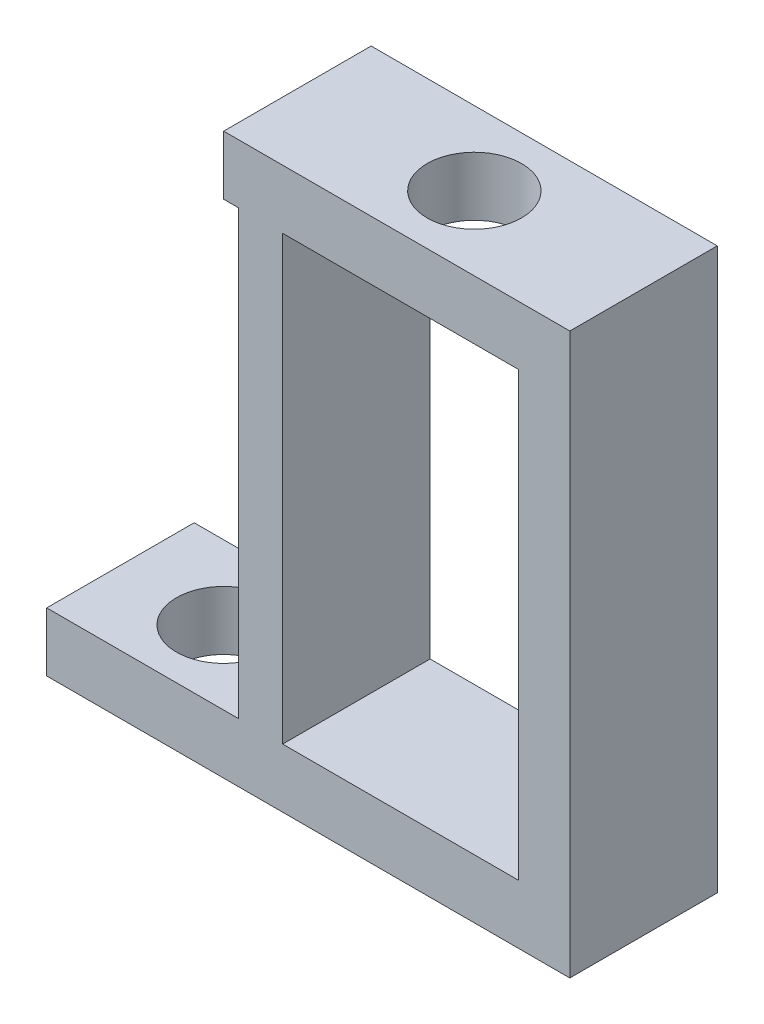
ISO-10303-21;
HEADER;
FILE_DESCRIPTION(('STEP AP214'),'2;1');
FILE_NAME('part.step','',(''),(''),'','','');
FILE_SCHEMA(('AUTOMOTIVE_DESIGN { 1 0 10303 214 1 1 1 1 }'));
ENDSEC;
DATA;
#1=APPLICATION_CONTEXT('core data for automotive mechanical design processes');
#2=APPLICATION_PROTOCOL_DEFINITION('international standard','automotive_design',2000,#1);
#3=PRODUCT_CONTEXT('',#1,'mechanical');
#4=PRODUCT('Part','Part','',(#3));
#5=PRODUCT_RELATED_PRODUCT_CATEGORY('part','',(#4));
#6=PRODUCT_DEFINITION_FORMATION('','',#4);
#7=PRODUCT_DEFINITION_CONTEXT('part definition',#1,'design');
#8=PRODUCT_DEFINITION('design','',#6,#7);
#9=PRODUCT_DEFINITION_SHAPE('','',#8);
#10=(LENGTH_UNIT() NAMED_UNIT(*) SI_UNIT(.MILLI.,.METRE.));
#11=(NAMED_UNIT(*) PLANE_ANGLE_UNIT() SI_UNIT($,.RADIAN.));
#12=(NAMED_UNIT(*) SI_UNIT($,.STERADIAN.) SOLID_ANGLE_UNIT());
#13=UNCERTAINTY_MEASURE_WITH_UNIT(LENGTH_MEASURE(1.E-05),#10,'distance_accuracy_value','');
#14=(GEOMETRIC_REPRESENTATION_CONTEXT(3) GLOBAL_UNCERTAINTY_ASSIGNED_CONTEXT((#13)) GLOBAL_UNIT_ASSIGNED_CONTEXT((#10,
#11,#12)) REPRESENTATION_CONTEXT('',''));
#15=CARTESIAN_POINT('',(0.,0.,0.));
#16=DIRECTION('',(0.,0.,1.));
#17=DIRECTION('',(1.,0.,0.));
#18=AXIS2_PLACEMENT_3D('',#15,#16,#17);
#19=CARTESIAN_POINT('',(0.,0.,0.));
#20=DIRECTION('',(0.,1.,0.));
#21=DIRECTION('',(0.,0.,1.));
#22=AXIS2_PLACEMENT_3D('',#19,#20,#21);
#23=PLANE('',#22);
#24=DIRECTION('',(0.,0.,-1.));
#25=VECTOR('',#24,1.);
#26=CARTESIAN_POINT('',(-6.5,0.,2.));
#27=LINE('',#26,#25);
#28=CARTESIAN_POINT('',(-6.5,0.,2.));
#29=VERTEX_POINT('',#28);
#30=CARTESIAN_POINT('',(-6.5,0.,-3.));
#31=VERTEX_POINT('',#30);
#32=EDGE_CURVE('E213',#29,#31,#27,.T.);
#33=ORIENTED_EDGE('',*,*,#32,.F.);
#34=DIRECTION('',(1.,0.,0.));
#35=VECTOR('',#34,1.);
#36=CARTESIAN_POINT('',(-7.,0.,2.));
#37=LINE('',#36,#35);
#38=CARTESIAN_POINT('',(-7.,0.,2.));
#39=VERTEX_POINT('',#38);
#40=EDGE_CURVE('E228',#39,#29,#37,.T.);
#41=ORIENTED_EDGE('',*,*,#40,.F.);
#42=DIRECTION('',(0.,0.,1.));
#43=VECTOR('',#42,1.);
#44=CARTESIAN_POINT('',(-7.,0.,-3.));
#45=LINE('',#44,#43);
#46=CARTESIAN_POINT('',(-7.,0.,-3.));
#47=VERTEX_POINT('',#46);
#48=EDGE_CURVE('E237',#47,#39,#45,.T.);
#49=ORIENTED_EDGE('',*,*,#48,.F.);
#50=DIRECTION('',(-1.,0.,0.));
#51=VECTOR('',#50,1.);
#52=CARTESIAN_POINT('',(-7.,0.,-3.));
#53=LINE('',#52,#51);
#54=EDGE_CURVE('E53',#31,#47,#53,.T.);
#55=ORIENTED_EDGE('',*,*,#54,.F.);
#56=EDGE_LOOP('',(#33,#41,#49,#55));
#57=FACE_BOUND('',#56,.T.);
#58=ADVANCED_FACE('F35',(#57),#23,.F.);
#59=CARTESIAN_POINT('',(-0.999999999999999,0.,-0.500000000000001));
#60=DIRECTION('',(0.,1.,0.));
#61=DIRECTION('',(0.,0.,1.));
#62=AXIS2_PLACEMENT_3D('',#59,#60,#61);
#63=CIRCLE('',#62,1.6);
#64=CARTESIAN_POINT('',(-0.999999999999999,0.,1.1));
#65=VERTEX_POINT('',#64);
#66=EDGE_CURVE('E210',#65,#65,#63,.T.);
#67=ORIENTED_EDGE('',*,*,#66,.T.);
#68=EDGE_LOOP('',(#67));
#69=FACE_BOUND('',#68,.T.);
#70=DIRECTION('',(0.,0.,1.));
#71=VECTOR('',#70,1.);
#72=CARTESIAN_POINT('',(-5.,0.,2.));
#73=LINE('',#72,#71);
#74=CARTESIAN_POINT('',(-5.,0.,-3.));
#75=VERTEX_POINT('',#74);
#76=CARTESIAN_POINT('',(-5.,0.,2.));
#77=VERTEX_POINT('',#76);
#78=EDGE_CURVE('E198',#75,#77,#73,.T.);
#79=ORIENTED_EDGE('',*,*,#78,.F.);
#80=CARTESIAN_POINT('',(3.,0.,-3.));
#81=VERTEX_POINT('',#80);
#82=EDGE_CURVE('E255',#81,#75,#53,.T.);
#83=ORIENTED_EDGE('',*,*,#82,.F.);
#84=DIRECTION('',(0.,0.,-1.));
#85=VECTOR('',#84,1.);
#86=CARTESIAN_POINT('',(3.,0.,-3.));
#87=LINE('',#86,#85);
#88=CARTESIAN_POINT('',(3.,0.,2.));
#89=VERTEX_POINT('',#88);
#90=EDGE_CURVE('E135',#89,#81,#87,.T.);
#91=ORIENTED_EDGE('',*,*,#90,.F.);
#92=EDGE_CURVE('E232',#77,#89,#37,.T.);
#93=ORIENTED_EDGE('',*,*,#92,.F.);
#94=EDGE_LOOP('',(#79,#83,#91,#93));
#95=FACE_BOUND('',#94,.T.);
#96=ADVANCED_FACE('F262',(#69,#95),#23,.F.);
#97=CARTESIAN_POINT('',(0.,2.,0.));
#98=DIRECTION('',(0.,1.,0.));
#99=DIRECTION('',(0.,0.,1.));
#100=AXIS2_PLACEMENT_3D('',#97,#98,#99);
#101=PLANE('',#100);
#102=DIRECTION('',(1.,0.,0.));
#103=VECTOR('',#102,1.);
#104=CARTESIAN_POINT('',(-7.,2.,2.));
#105=LINE('',#104,#103);
#106=CARTESIAN_POINT('',(-7.,2.,2.));
#107=VERTEX_POINT('',#106);
#108=CARTESIAN_POINT('',(4.73770260739299,2.,2.));
#109=VERTEX_POINT('',#108);
#110=EDGE_CURVE('E246',#107,#109,#105,.T.);
#111=ORIENTED_EDGE('',*,*,#110,.T.);
#112=DIRECTION('',(0.,0.,1.));
#113=VECTOR('',#112,1.);
#114=CARTESIAN_POINT('',(4.73770260739299,2.,-3.));
#115=LINE('',#114,#113);
#116=CARTESIAN_POINT('',(4.73770260739299,2.,-3.));
#117=VERTEX_POINT('',#116);
#118=EDGE_CURVE('E159',#117,#109,#115,.T.);
#119=ORIENTED_EDGE('',*,*,#118,.F.);
#120=DIRECTION('',(-1.,0.,0.));
#121=VECTOR('',#120,1.);
#122=CARTESIAN_POINT('',(-7.,2.,-3.));
#123=LINE('',#122,#121);
#124=CARTESIAN_POINT('',(-7.,2.,-3.));
#125=VERTEX_POINT('',#124);
#126=EDGE_CURVE('E231',#117,#125,#123,.T.);
#127=ORIENTED_EDGE('',*,*,#126,.T.);
#128=DIRECTION('',(0.,0.,1.));
#129=VECTOR('',#128,1.);
#130=CARTESIAN_POINT('',(-7.,2.,-3.));
#131=LINE('',#130,#129);
#132=EDGE_CURVE('E234',#125,#107,#131,.T.);
#133=ORIENTED_EDGE('',*,*,#132,.T.);
#134=EDGE_LOOP('',(#111,#119,#127,#133));
#135=FACE_BOUND('',#134,.T.);
#136=CARTESIAN_POINT('',(-0.999999999999999,2.,-0.500000000000001));
#137=DIRECTION('',(0.,1.,0.));
#138=DIRECTION('',(0.,0.,1.));
#139=AXIS2_PLACEMENT_3D('',#136,#137,#138);
#140=CIRCLE('',#139,1.6);
#141=CARTESIAN_POINT('',(-0.999999999999999,2.,1.1));
#142=VERTEX_POINT('',#141);
#143=EDGE_CURVE('E252',#142,#142,#140,.T.);
#144=ORIENTED_EDGE('',*,*,#143,.F.);
#145=EDGE_LOOP('',(#144));
#146=FACE_BOUND('',#145,.T.);
#147=ADVANCED_FACE('F267',(#135,#146),#101,.T.);
#148=CARTESIAN_POINT('',(-7.,2.,-3.));
#149=DIRECTION('',(0.,0.,1.));
#150=DIRECTION('',(1.,0.,0.));
#151=AXIS2_PLACEMENT_3D('',#148,#149,#150);
#152=PLANE('',#151);
#153=DIRECTION('',(0.,-1.,0.));
#154=VECTOR('',#153,1.);
#155=CARTESIAN_POINT('',(3.,2.,-3.));
#156=LINE('',#155,#154);
#157=CARTESIAN_POINT('',(3.,-15.,-3.));
#158=VERTEX_POINT('',#157);
#159=EDGE_CURVE('E129',#81,#158,#156,.T.);
#160=ORIENTED_EDGE('',*,*,#159,.F.);
#161=ORIENTED_EDGE('',*,*,#82,.T.);
#162=DIRECTION('',(0.,1.,0.));
#163=VECTOR('',#162,1.);
#164=CARTESIAN_POINT('',(-5.,-15.,-3.));
#165=LINE('',#164,#163);
#166=CARTESIAN_POINT('',(-5.,-15.,-3.));
#167=VERTEX_POINT('',#166);
#168=EDGE_CURVE('E39',#167,#75,#165,.T.);
#169=ORIENTED_EDGE('',*,*,#168,.F.);
#170=DIRECTION('',(-1.,0.,0.));
#171=VECTOR('',#170,1.);
#172=CARTESIAN_POINT('',(3.,-15.,-3.));
#173=LINE('',#172,#171);
#174=EDGE_CURVE('E139',#158,#167,#173,.T.);
#175=ORIENTED_EDGE('',*,*,#174,.F.);
#176=EDGE_LOOP('',(#160,#161,#169,#175));
#177=FACE_BOUND('',#176,.T.);
#178=ORIENTED_EDGE('',*,*,#126,.F.);
#179=DIRECTION('',(0.,1.,0.));
#180=VECTOR('',#179,1.);
#181=CARTESIAN_POINT('',(4.73770260739299,-17.,-3.));
#182=LINE('',#181,#180);
#183=CARTESIAN_POINT('',(4.73770260739299,-17.,-3.));
#184=VERTEX_POINT('',#183);
#185=EDGE_CURVE('E147',#184,#117,#182,.T.);
#186=ORIENTED_EDGE('',*,*,#185,.F.);
#187=DIRECTION('',(1.,0.,0.));
#188=VECTOR('',#187,1.);
#189=CARTESIAN_POINT('',(-5.,-17.,-3.));
#190=LINE('',#189,#188);
#191=CARTESIAN_POINT('',(-13.,-17.,-3.));
#192=VERTEX_POINT('',#191);
#193=EDGE_CURVE('E178',#192,#184,#190,.T.);
#194=ORIENTED_EDGE('',*,*,#193,.F.);
#195=DIRECTION('',(0.,1.,0.));
#196=VECTOR('',#195,1.);
#197=CARTESIAN_POINT('',(-13.,-17.,-3.));
#198=LINE('',#197,#196);
#199=CARTESIAN_POINT('',(-13.,-15.,-3.));
#200=VERTEX_POINT('',#199);
#201=EDGE_CURVE('E180',#192,#200,#198,.T.);
#202=ORIENTED_EDGE('',*,*,#201,.T.);
#203=DIRECTION('',(1.,0.,0.));
#204=VECTOR('',#203,1.);
#205=CARTESIAN_POINT('',(-5.,-15.,-3.));
#206=LINE('',#205,#204);
#207=CARTESIAN_POINT('',(-6.5,-15.,-3.));
#208=VERTEX_POINT('',#207);
#209=EDGE_CURVE('E176',#200,#208,#206,.T.);
#210=ORIENTED_EDGE('',*,*,#209,.T.);
#211=DIRECTION('',(0.,1.,0.));
#212=VECTOR('',#211,1.);
#213=CARTESIAN_POINT('',(-6.5,-15.,-3.));
#214=LINE('',#213,#212);
#215=EDGE_CURVE('E208',#208,#31,#214,.T.);
#216=ORIENTED_EDGE('',*,*,#215,.T.);
#217=ORIENTED_EDGE('',*,*,#54,.T.);
#218=DIRECTION('',(0.,-1.,0.));
#219=VECTOR('',#218,1.);
#220=CARTESIAN_POINT('',(-7.,2.,-3.));
#221=LINE('',#220,#219);
#222=EDGE_CURVE('E11',#125,#47,#221,.T.);
#223=ORIENTED_EDGE('',*,*,#222,.F.);
#224=EDGE_LOOP('',(#178,#186,#194,#202,#210,#216,#217,#223));
#225=FACE_BOUND('',#224,.T.);
#226=ADVANCED_FACE('F37',(#177,#225),#152,.F.);
#227=CARTESIAN_POINT('',(-7.,2.,-3.));
#228=DIRECTION('',(1.,0.,0.));
#229=DIRECTION('',(0.,0.,-1.));
#230=AXIS2_PLACEMENT_3D('',#227,#228,#229);
#231=PLANE('',#230);
#232=ORIENTED_EDGE('',*,*,#48,.T.);
#233=DIRECTION('',(0.,-1.,0.));
#234=VECTOR('',#233,1.);
#235=CARTESIAN_POINT('',(-7.,2.,2.));
#236=LINE('',#235,#234);
#237=EDGE_CURVE('E45',#107,#39,#236,.T.);
#238=ORIENTED_EDGE('',*,*,#237,.F.);
#239=ORIENTED_EDGE('',*,*,#132,.F.);
#240=ORIENTED_EDGE('',*,*,#222,.T.);
#241=EDGE_LOOP('',(#232,#238,#239,#240));
#242=FACE_BOUND('',#241,.T.);
#243=ADVANCED_FACE('F260',(#242),#231,.F.);
#244=CARTESIAN_POINT('',(-7.,2.,2.));
#245=DIRECTION('',(0.,0.,-1.));
#246=DIRECTION('',(-1.,0.,0.));
#247=AXIS2_PLACEMENT_3D('',#244,#245,#246);
#248=PLANE('',#247);
#249=ORIENTED_EDGE('',*,*,#92,.T.);
#250=DIRECTION('',(0.,-1.,0.));
#251=VECTOR('',#250,1.);
#252=CARTESIAN_POINT('',(3.,2.,2.));
#253=LINE('',#252,#251);
#254=CARTESIAN_POINT('',(3.,-15.,2.));
#255=VERTEX_POINT('',#254);
#256=EDGE_CURVE('E154',#89,#255,#253,.T.);
#257=ORIENTED_EDGE('',*,*,#256,.T.);
#258=DIRECTION('',(-1.,0.,0.));
#259=VECTOR('',#258,1.);
#260=CARTESIAN_POINT('',(3.,-15.,2.));
#261=LINE('',#260,#259);
#262=CARTESIAN_POINT('',(-5.,-15.,2.));
#263=VERTEX_POINT('',#262);
#264=EDGE_CURVE('E145',#255,#263,#261,.T.);
#265=ORIENTED_EDGE('',*,*,#264,.T.);
#266=DIRECTION('',(0.,1.,0.));
#267=VECTOR('',#266,1.);
#268=CARTESIAN_POINT('',(-5.,-15.,2.));
#269=LINE('',#268,#267);
#270=EDGE_CURVE('E201',#263,#77,#269,.T.);
#271=ORIENTED_EDGE('',*,*,#270,.T.);
#272=EDGE_LOOP('',(#249,#257,#265,#271));
#273=FACE_BOUND('',#272,.T.);
#274=ORIENTED_EDGE('',*,*,#40,.T.);
#275=DIRECTION('',(0.,1.,0.));
#276=VECTOR('',#275,1.);
#277=CARTESIAN_POINT('',(-6.5,-15.,2.));
#278=LINE('',#277,#276);
#279=CARTESIAN_POINT('',(-6.5,-15.,2.));
#280=VERTEX_POINT('',#279);
#281=EDGE_CURVE('E197',#280,#29,#278,.T.);
#282=ORIENTED_EDGE('',*,*,#281,.F.);
#283=DIRECTION('',(-1.,0.,0.));
#284=VECTOR('',#283,1.);
#285=CARTESIAN_POINT('',(-5.,-15.,2.));
#286=LINE('',#285,#284);
#287=CARTESIAN_POINT('',(-13.,-15.,2.));
#288=VERTEX_POINT('',#287);
#289=EDGE_CURVE('E170',#280,#288,#286,.T.);
#290=ORIENTED_EDGE('',*,*,#289,.T.);
#291=DIRECTION('',(0.,1.,0.));
#292=VECTOR('',#291,1.);
#293=CARTESIAN_POINT('',(-13.,-17.,2.));
#294=LINE('',#293,#292);
#295=CARTESIAN_POINT('',(-13.,-17.,2.));
#296=VERTEX_POINT('',#295);
#297=EDGE_CURVE('E215',#296,#288,#294,.T.);
#298=ORIENTED_EDGE('',*,*,#297,.F.);
#299=DIRECTION('',(-1.,0.,0.));
#300=VECTOR('',#299,1.);
#301=CARTESIAN_POINT('',(-5.,-17.,2.));
#302=LINE('',#301,#300);
#303=CARTESIAN_POINT('',(4.73770260739299,-17.,2.));
#304=VERTEX_POINT('',#303);
#305=EDGE_CURVE('E173',#304,#296,#302,.T.);
#306=ORIENTED_EDGE('',*,*,#305,.F.);
#307=DIRECTION('',(0.,1.,0.));
#308=VECTOR('',#307,1.);
#309=CARTESIAN_POINT('',(4.73770260739299,-17.,2.));
#310=LINE('',#309,#308);
#311=EDGE_CURVE('E140',#304,#109,#310,.T.);
#312=ORIENTED_EDGE('',*,*,#311,.T.);
#313=ORIENTED_EDGE('',*,*,#110,.F.);
#314=ORIENTED_EDGE('',*,*,#237,.T.);
#315=EDGE_LOOP('',(#274,#282,#290,#298,#306,#312,#313,#314));
#316=FACE_BOUND('',#315,.T.);
#317=ADVANCED_FACE('F223',(#273,#316),#248,.F.);
#318=CARTESIAN_POINT('',(-0.999999999999999,2.,-0.500000000000001));
#319=DIRECTION('',(0.,-1.,0.));
#320=DIRECTION('',(0.,0.,-1.));
#321=AXIS2_PLACEMENT_3D('',#318,#319,#320);
#322=CYLINDRICAL_SURFACE('',#321,1.6);
#323=ORIENTED_EDGE('',*,*,#143,.T.);
#324=EDGE_LOOP('',(#323));
#325=FACE_BOUND('',#324,.T.);
#326=ORIENTED_EDGE('',*,*,#66,.F.);
#327=EDGE_LOOP('',(#326));
#328=FACE_BOUND('',#327,.T.);
#329=ADVANCED_FACE('F273',(#325,#328),#322,.F.);
#330=CARTESIAN_POINT('',(-6.5,-15.,2.));
#331=DIRECTION('',(1.,0.,0.));
#332=DIRECTION('',(0.,0.,-1.));
#333=AXIS2_PLACEMENT_3D('',#330,#331,#332);
#334=PLANE('',#333);
#335=ORIENTED_EDGE('',*,*,#32,.T.);
#336=ORIENTED_EDGE('',*,*,#215,.F.);
#337=DIRECTION('',(0.,0.,-1.));
#338=VECTOR('',#337,1.);
#339=CARTESIAN_POINT('',(-6.5,-15.,2.));
#340=LINE('',#339,#338);
#341=EDGE_CURVE('E194',#280,#208,#340,.T.);
#342=ORIENTED_EDGE('',*,*,#341,.F.);
#343=ORIENTED_EDGE('',*,*,#281,.T.);
#344=EDGE_LOOP('',(#335,#336,#342,#343));
#345=FACE_BOUND('',#344,.T.);
#346=ADVANCED_FACE('F219',(#345),#334,.F.);
#347=CARTESIAN_POINT('',(-5.,-15.,2.));
#348=DIRECTION('',(-1.,0.,0.));
#349=DIRECTION('',(0.,0.,1.));
#350=AXIS2_PLACEMENT_3D('',#347,#348,#349);
#351=PLANE('',#350);
#352=ORIENTED_EDGE('',*,*,#270,.F.);
#353=DIRECTION('',(0.,0.,1.));
#354=VECTOR('',#353,1.);
#355=CARTESIAN_POINT('',(-5.,-15.,-3.));
#356=LINE('',#355,#354);
#357=EDGE_CURVE('E146',#167,#263,#356,.T.);
#358=ORIENTED_EDGE('',*,*,#357,.F.);
#359=ORIENTED_EDGE('',*,*,#168,.T.);
#360=ORIENTED_EDGE('',*,*,#78,.T.);
#361=EDGE_LOOP('',(#352,#358,#359,#360));
#362=FACE_BOUND('',#361,.T.);
#363=ADVANCED_FACE('F299',(#362),#351,.F.);
#364=CARTESIAN_POINT('',(0.,-17.,0.));
#365=DIRECTION('',(0.,1.,0.));
#366=DIRECTION('',(0.,0.,1.));
#367=AXIS2_PLACEMENT_3D('',#364,#365,#366);
#368=PLANE('',#367);
#369=ORIENTED_EDGE('',*,*,#193,.T.);
#370=DIRECTION('',(0.,0.,1.));
#371=VECTOR('',#370,1.);
#372=CARTESIAN_POINT('',(4.73770260739299,-17.,-3.));
#373=LINE('',#372,#371);
#374=EDGE_CURVE('E163',#184,#304,#373,.T.);
#375=ORIENTED_EDGE('',*,*,#374,.T.);
#376=ORIENTED_EDGE('',*,*,#305,.T.);
#377=DIRECTION('',(0.,0.,-1.));
#378=VECTOR('',#377,1.);
#379=CARTESIAN_POINT('',(-13.,-17.,2.));
#380=LINE('',#379,#378);
#381=EDGE_CURVE('E175',#296,#192,#380,.T.);
#382=ORIENTED_EDGE('',*,*,#381,.T.);
#383=EDGE_LOOP('',(#369,#375,#376,#382));
#384=FACE_BOUND('',#383,.T.);
#385=CARTESIAN_POINT('',(-9.5,-17.,-0.500000000000001));
#386=DIRECTION('',(0.,-1.,0.));
#387=DIRECTION('',(0.,0.,-1.));
#388=AXIS2_PLACEMENT_3D('',#385,#386,#387);
#389=CIRCLE('',#388,1.6);
#390=CARTESIAN_POINT('',(-9.5,-17.,-2.1));
#391=VERTEX_POINT('',#390);
#392=EDGE_CURVE('E167',#391,#391,#389,.T.);
#393=ORIENTED_EDGE('',*,*,#392,.F.);
#394=EDGE_LOOP('',(#393));
#395=FACE_BOUND('',#394,.T.);
#396=ADVANCED_FACE('F304',(#384,#395),#368,.F.);
#397=CARTESIAN_POINT('',(0.,-15.,0.));
#398=DIRECTION('',(0.,1.,0.));
#399=DIRECTION('',(0.,0.,1.));
#400=AXIS2_PLACEMENT_3D('',#397,#398,#399);
#401=PLANE('',#400);
#402=ORIENTED_EDGE('',*,*,#289,.F.);
#403=ORIENTED_EDGE('',*,*,#341,.T.);
#404=ORIENTED_EDGE('',*,*,#209,.F.);
#405=DIRECTION('',(0.,0.,-1.));
#406=VECTOR('',#405,1.);
#407=CARTESIAN_POINT('',(-13.,-15.,2.));
#408=LINE('',#407,#406);
#409=EDGE_CURVE('E183',#288,#200,#408,.T.);
#410=ORIENTED_EDGE('',*,*,#409,.F.);
#411=EDGE_LOOP('',(#402,#403,#404,#410));
#412=FACE_BOUND('',#411,.T.);
#413=CARTESIAN_POINT('',(-9.5,-15.,-0.500000000000001));
#414=DIRECTION('',(0.,-1.,0.));
#415=DIRECTION('',(0.,0.,-1.));
#416=AXIS2_PLACEMENT_3D('',#413,#414,#415);
#417=CIRCLE('',#416,1.6);
#418=CARTESIAN_POINT('',(-9.5,-15.,-2.1));
#419=VERTEX_POINT('',#418);
#420=EDGE_CURVE('E162',#419,#419,#417,.T.);
#421=ORIENTED_EDGE('',*,*,#420,.T.);
#422=EDGE_LOOP('',(#421));
#423=FACE_BOUND('',#422,.T.);
#424=ADVANCED_FACE('F309',(#412,#423),#401,.T.);
#425=CARTESIAN_POINT('',(-13.,-17.,2.));
#426=DIRECTION('',(1.,0.,0.));
#427=DIRECTION('',(0.,0.,-1.));
#428=AXIS2_PLACEMENT_3D('',#425,#426,#427);
#429=PLANE('',#428);
#430=ORIENTED_EDGE('',*,*,#409,.T.);
#431=ORIENTED_EDGE('',*,*,#201,.F.);
#432=ORIENTED_EDGE('',*,*,#381,.F.);
#433=ORIENTED_EDGE('',*,*,#297,.T.);
#434=EDGE_LOOP('',(#430,#431,#432,#433));
#435=FACE_BOUND('',#434,.T.);
#436=ADVANCED_FACE('F305',(#435),#429,.F.);
#437=CARTESIAN_POINT('',(-9.5,-17.,-0.500000000000001));
#438=DIRECTION('',(0.,1.,0.));
#439=DIRECTION('',(0.,0.,1.));
#440=AXIS2_PLACEMENT_3D('',#437,#438,#439);
#441=CYLINDRICAL_SURFACE('',#440,1.6);
#442=ORIENTED_EDGE('',*,*,#392,.T.);
#443=EDGE_LOOP('',(#442));
#444=FACE_BOUND('',#443,.T.);
#445=ORIENTED_EDGE('',*,*,#420,.F.);
#446=EDGE_LOOP('',(#445));
#447=FACE_BOUND('',#446,.T.);
#448=ADVANCED_FACE('F308',(#444,#447),#441,.F.);
#449=CARTESIAN_POINT('',(3.,2.,-3.));
#450=DIRECTION('',(-1.,0.,0.));
#451=DIRECTION('',(0.,0.,1.));
#452=AXIS2_PLACEMENT_3D('',#449,#450,#451);
#453=PLANE('',#452);
#454=ORIENTED_EDGE('',*,*,#90,.T.);
#455=ORIENTED_EDGE('',*,*,#159,.T.);
#456=DIRECTION('',(0.,0.,1.));
#457=VECTOR('',#456,1.);
#458=CARTESIAN_POINT('',(3.,-15.,-3.));
#459=LINE('',#458,#457);
#460=EDGE_CURVE('E133',#158,#255,#459,.T.);
#461=ORIENTED_EDGE('',*,*,#460,.T.);
#462=ORIENTED_EDGE('',*,*,#256,.F.);
#463=EDGE_LOOP('',(#454,#455,#461,#462));
#464=FACE_BOUND('',#463,.T.);
#465=ADVANCED_FACE('F131',(#464),#453,.T.);
#466=CARTESIAN_POINT('',(4.73770260739299,-17.,-3.));
#467=DIRECTION('',(1.,0.,0.));
#468=DIRECTION('',(0.,0.,-1.));
#469=AXIS2_PLACEMENT_3D('',#466,#467,#468);
#470=PLANE('',#469);
#471=ORIENTED_EDGE('',*,*,#311,.F.);
#472=ORIENTED_EDGE('',*,*,#374,.F.);
#473=ORIENTED_EDGE('',*,*,#185,.T.);
#474=ORIENTED_EDGE('',*,*,#118,.T.);
#475=EDGE_LOOP('',(#471,#472,#473,#474));
#476=FACE_BOUND('',#475,.T.);
#477=ADVANCED_FACE('F322',(#476),#470,.T.);
#478=CARTESIAN_POINT('',(3.,-15.,-3.));
#479=DIRECTION('',(0.,1.,0.));
#480=DIRECTION('',(0.,0.,1.));
#481=AXIS2_PLACEMENT_3D('',#478,#479,#480);
#482=PLANE('',#481);
#483=ORIENTED_EDGE('',*,*,#264,.F.);
#484=ORIENTED_EDGE('',*,*,#460,.F.);
#485=ORIENTED_EDGE('',*,*,#174,.T.);
#486=ORIENTED_EDGE('',*,*,#357,.T.);
#487=EDGE_LOOP('',(#483,#484,#485,#486));
#488=FACE_BOUND('',#487,.T.);
#489=ADVANCED_FACE('F143',(#488),#482,.T.);
#490=CLOSED_SHELL('',(#58,#96,#147,#226,#243,#317,#329,#346,#363,#396,#424,#436,#448,#465,#477,#489));
#491=MANIFOLD_SOLID_BREP('B2',#490);
#492=ADVANCED_BREP_SHAPE_REPRESENTATION('',(#18,#491),#14);
#493=SHAPE_DEFINITION_REPRESENTATION(#9,#492);
ENDSEC;
END-ISO-10303-21;
